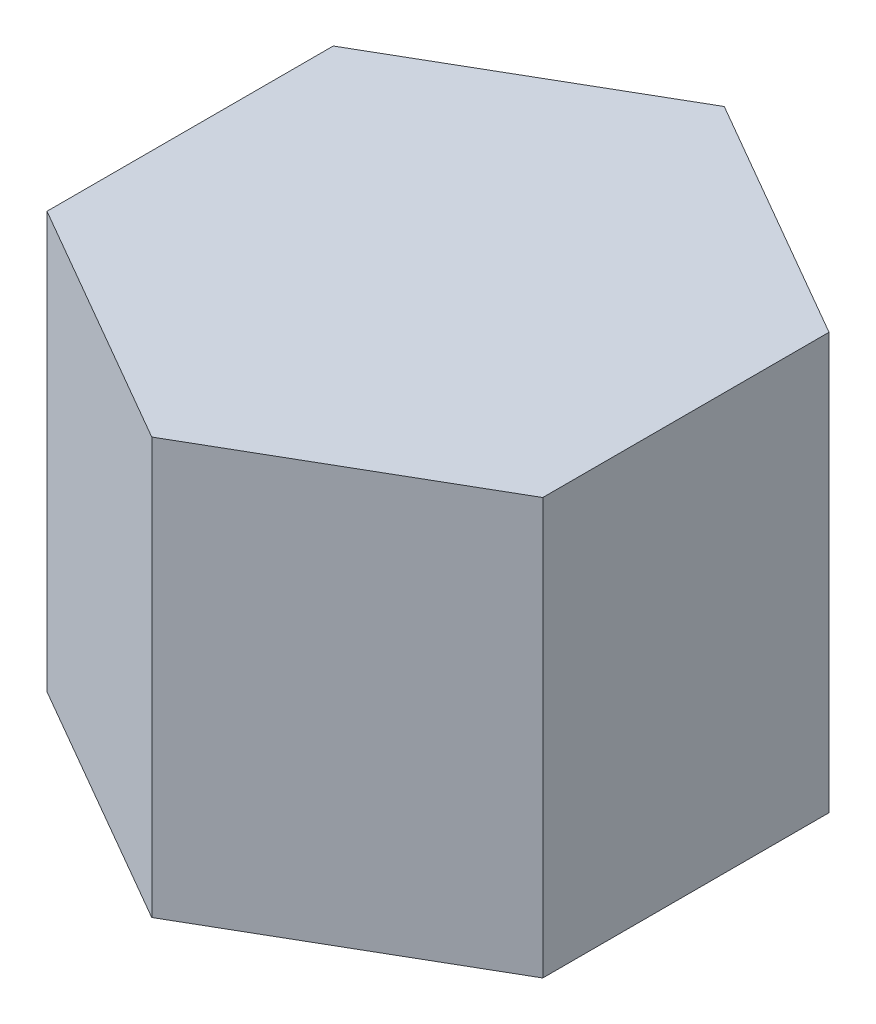
ISO-10303-21;
HEADER;
FILE_DESCRIPTION(('STEP AP214'),'2;1');
FILE_NAME('part.step','',(''),(''),'','','');
FILE_SCHEMA(('AUTOMOTIVE_DESIGN { 1 0 10303 214 1 1 1 1 }'));
ENDSEC;
DATA;
#1=APPLICATION_CONTEXT('core data for automotive mechanical design processes');
#2=APPLICATION_PROTOCOL_DEFINITION('international standard','automotive_design',2000,#1);
#3=PRODUCT_CONTEXT('',#1,'mechanical');
#4=PRODUCT('Part','Part','',(#3));
#5=PRODUCT_RELATED_PRODUCT_CATEGORY('part','',(#4));
#6=PRODUCT_DEFINITION_FORMATION('','',#4);
#7=PRODUCT_DEFINITION_CONTEXT('part definition',#1,'design');
#8=PRODUCT_DEFINITION('design','',#6,#7);
#9=PRODUCT_DEFINITION_SHAPE('','',#8);
#10=(LENGTH_UNIT() NAMED_UNIT(*) SI_UNIT(.MILLI.,.METRE.));
#11=(NAMED_UNIT(*) PLANE_ANGLE_UNIT() SI_UNIT($,.RADIAN.));
#12=(NAMED_UNIT(*) SI_UNIT($,.STERADIAN.) SOLID_ANGLE_UNIT());
#13=UNCERTAINTY_MEASURE_WITH_UNIT(LENGTH_MEASURE(1.E-05),#10,'distance_accuracy_value','');
#14=(GEOMETRIC_REPRESENTATION_CONTEXT(3) GLOBAL_UNCERTAINTY_ASSIGNED_CONTEXT((#13)) GLOBAL_UNIT_ASSIGNED_CONTEXT((#10,
#11,#12)) REPRESENTATION_CONTEXT('',''));
#15=CARTESIAN_POINT('',(0.,0.,0.));
#16=DIRECTION('',(0.,0.,1.));
#17=DIRECTION('',(1.,0.,0.));
#18=AXIS2_PLACEMENT_3D('',#15,#16,#17);
#19=CARTESIAN_POINT('',(206.339551417382,-147.556598747966,293.414022028063));
#20=DIRECTION('',(-0.500000000000096,0.,-0.866025403784383));
#21=DIRECTION('',(-0.866025403784383,0.,0.500000000000096));
#22=AXIS2_PLACEMENT_3D('',#19,#20,#21);
#23=PLANE('',#22);
#24=CARTESIAN_POINT('',(206.642660308706,-147.047793579175,293.239022028063));
#25=DIRECTION('',(-0.866025403784383,0.,0.500000000000096));
#26=VECTOR('',#25,1.);
#27=LINE('',#24,#26);
#28=CARTESIAN_POINT('',(206.642660308706,-147.047793579175,293.239022028063));
#29=VERTEX_POINT('',#28);
#30=CARTESIAN_POINT('',(206.339551417382,-147.047793579175,293.414022028063));
#31=VERTEX_POINT('',#30);
#32=EDGE_CURVE('E170',#29,#31,#27,.T.);
#33=ORIENTED_EDGE('',*,*,#32,.T.);
#34=CARTESIAN_POINT('',(206.339551417382,-147.556598747966,293.414022028063));
#35=DIRECTION('',(0.,1.,0.));
#36=VECTOR('',#35,1.);
#37=LINE('',#34,#36);
#38=CARTESIAN_POINT('',(206.339551417382,-147.556598747966,293.414022028063));
#39=VERTEX_POINT('',#38);
#40=EDGE_CURVE('E35',#39,#31,#37,.T.);
#41=ORIENTED_EDGE('',*,*,#40,.F.);
#42=CARTESIAN_POINT('',(206.642660308706,-147.556598747966,293.239022028063));
#43=DIRECTION('',(-0.866025403784383,0.,0.500000000000096));
#44=VECTOR('',#43,1.);
#45=LINE('',#42,#44);
#46=CARTESIAN_POINT('',(206.642660308706,-147.556598747966,293.239022028063));
#47=VERTEX_POINT('',#46);
#48=EDGE_CURVE('E159',#47,#39,#45,.T.);
#49=ORIENTED_EDGE('',*,*,#48,.F.);
#50=CARTESIAN_POINT('',(206.642660308706,-147.556598747966,293.239022028063));
#51=DIRECTION('',(0.,1.,0.));
#52=VECTOR('',#51,1.);
#53=LINE('',#50,#52);
#54=EDGE_CURVE('E10',#47,#29,#53,.T.);
#55=ORIENTED_EDGE('',*,*,#54,.T.);
#56=EDGE_LOOP('',(#33,#41,#49,#55));
#57=FACE_BOUND('',#56,.T.);
#58=ADVANCED_FACE('F16',(#57),#23,.F.);
#59=CARTESIAN_POINT('',(206.642660308706,-147.556598747966,291.594471220494));
#60=DIRECTION('',(-1.,0.,0.));
#61=DIRECTION('',(0.,-1.,0.));
#62=AXIS2_PLACEMENT_3D('',#59,#60,#61);
#63=PLANE('',#62);
#64=CARTESIAN_POINT('',(206.642660308706,-147.047793579175,292.889022028063));
#65=DIRECTION('',(0.,0.,1.));
#66=VECTOR('',#65,1.);
#67=LINE('',#64,#66);
#68=CARTESIAN_POINT('',(206.642660308706,-147.047793579175,292.889022028063));
#69=VERTEX_POINT('',#68);
#70=EDGE_CURVE('E167',#69,#29,#67,.T.);
#71=ORIENTED_EDGE('',*,*,#70,.T.);
#72=ORIENTED_EDGE('',*,*,#54,.F.);
#73=CARTESIAN_POINT('',(206.642660308706,-147.556598747966,292.889022028063));
#74=DIRECTION('',(0.,0.,1.));
#75=VECTOR('',#74,1.);
#76=LINE('',#73,#75);
#77=CARTESIAN_POINT('',(206.642660308706,-147.556598747966,292.889022028063));
#78=VERTEX_POINT('',#77);
#79=EDGE_CURVE('E156',#78,#47,#76,.T.);
#80=ORIENTED_EDGE('',*,*,#79,.F.);
#81=CARTESIAN_POINT('',(206.642660308706,-147.556598747966,292.889022028063));
#82=DIRECTION('',(0.,1.,0.));
#83=VECTOR('',#82,1.);
#84=LINE('',#81,#83);
#85=EDGE_CURVE('E27',#78,#69,#84,.T.);
#86=ORIENTED_EDGE('',*,*,#85,.T.);
#87=EDGE_LOOP('',(#71,#72,#80,#86));
#88=FACE_BOUND('',#87,.T.);
#89=ADVANCED_FACE('F189',(#88),#63,.F.);
#90=CARTESIAN_POINT('',(206.642660308706,-147.556598747966,292.889022028063));
#91=DIRECTION('',(-0.500000000000062,0.,0.866025403784403));
#92=DIRECTION('',(0.866025403784403,0.,0.500000000000062));
#93=AXIS2_PLACEMENT_3D('',#90,#91,#92);
#94=PLANE('',#93);
#95=CARTESIAN_POINT('',(206.339551417381,-147.047793579175,292.714022028063));
#96=DIRECTION('',(0.866025403784403,0.,0.500000000000062));
#97=VECTOR('',#96,1.);
#98=LINE('',#95,#97);
#99=CARTESIAN_POINT('',(206.339551417382,-147.047793579175,292.714022028063));
#100=VERTEX_POINT('',#99);
#101=EDGE_CURVE('E163',#100,#69,#98,.T.);
#102=ORIENTED_EDGE('',*,*,#101,.T.);
#103=ORIENTED_EDGE('',*,*,#85,.F.);
#104=CARTESIAN_POINT('',(206.339551417381,-147.556598747966,292.714022028063));
#105=DIRECTION('',(0.866025403784403,0.,0.500000000000062));
#106=VECTOR('',#105,1.);
#107=LINE('',#104,#106);
#108=CARTESIAN_POINT('',(206.339551417382,-147.556598747966,292.714022028063));
#109=VERTEX_POINT('',#108);
#110=EDGE_CURVE('E106',#109,#78,#107,.T.);
#111=ORIENTED_EDGE('',*,*,#110,.F.);
#112=CARTESIAN_POINT('',(206.339551417382,-147.556598747966,292.714022028063));
#113=DIRECTION('',(0.,1.,0.));
#114=VECTOR('',#113,1.);
#115=LINE('',#112,#114);
#116=EDGE_CURVE('E94',#109,#100,#115,.T.);
#117=ORIENTED_EDGE('',*,*,#116,.T.);
#118=EDGE_LOOP('',(#102,#103,#111,#117));
#119=FACE_BOUND('',#118,.T.);
#120=ADVANCED_FACE('F198',(#119),#94,.F.);
#121=CARTESIAN_POINT('',(206.339551417382,-147.556598747966,292.714022028063));
#122=DIRECTION('',(0.499999999999943,0.,0.866025403784471));
#123=DIRECTION('',(0.866025403784471,0.,-0.499999999999943));
#124=AXIS2_PLACEMENT_3D('',#121,#122,#123);
#125=PLANE('',#124);
#126=CARTESIAN_POINT('',(206.036442526057,-147.047793579175,292.889022028063));
#127=DIRECTION('',(0.866025403784471,0.,-0.499999999999943));
#128=VECTOR('',#127,1.);
#129=LINE('',#126,#128);
#130=CARTESIAN_POINT('',(206.036442526057,-147.047793579175,292.889022028063));
#131=VERTEX_POINT('',#130);
#132=EDGE_CURVE('E162',#131,#100,#129,.T.);
#133=ORIENTED_EDGE('',*,*,#132,.T.);
#134=ORIENTED_EDGE('',*,*,#116,.F.);
#135=CARTESIAN_POINT('',(206.036442526057,-147.556598747966,292.889022028063));
#136=DIRECTION('',(0.866025403784471,0.,-0.499999999999943));
#137=VECTOR('',#136,1.);
#138=LINE('',#135,#137);
#139=CARTESIAN_POINT('',(206.036442526057,-147.556598747966,292.889022028063));
#140=VERTEX_POINT('',#139);
#141=EDGE_CURVE('E98',#140,#109,#138,.T.);
#142=ORIENTED_EDGE('',*,*,#141,.F.);
#143=CARTESIAN_POINT('',(206.036442526057,-147.556598747966,292.889022028063));
#144=DIRECTION('',(0.,1.,0.));
#145=VECTOR('',#144,1.);
#146=LINE('',#143,#145);
#147=EDGE_CURVE('E79',#140,#131,#146,.T.);
#148=ORIENTED_EDGE('',*,*,#147,.T.);
#149=EDGE_LOOP('',(#133,#134,#142,#148));
#150=FACE_BOUND('',#149,.T.);
#151=ADVANCED_FACE('F100',(#150),#125,.F.);
#152=CARTESIAN_POINT('',(206.036442526057,-147.556598747966,291.594471220494));
#153=DIRECTION('',(1.,0.,0.));
#154=DIRECTION('',(0.,1.,0.));
#155=AXIS2_PLACEMENT_3D('',#152,#153,#154);
#156=PLANE('',#155);
#157=CARTESIAN_POINT('',(206.036442526057,-147.047793579175,293.239022028063));
#158=DIRECTION('',(0.,0.,-1.));
#159=VECTOR('',#158,1.);
#160=LINE('',#157,#159);
#161=CARTESIAN_POINT('',(206.036442526057,-147.047793579175,293.239022028063));
#162=VERTEX_POINT('',#161);
#163=EDGE_CURVE('E88',#162,#131,#160,.T.);
#164=ORIENTED_EDGE('',*,*,#163,.T.);
#165=ORIENTED_EDGE('',*,*,#147,.F.);
#166=CARTESIAN_POINT('',(206.036442526057,-147.556598747966,293.239022028063));
#167=DIRECTION('',(0.,0.,-1.));
#168=VECTOR('',#167,1.);
#169=LINE('',#166,#168);
#170=CARTESIAN_POINT('',(206.036442526057,-147.556598747966,293.239022028063));
#171=VERTEX_POINT('',#170);
#172=EDGE_CURVE('E84',#171,#140,#169,.T.);
#173=ORIENTED_EDGE('',*,*,#172,.F.);
#174=CARTESIAN_POINT('',(206.036442526057,-147.556598747966,293.239022028063));
#175=DIRECTION('',(0.,1.,0.));
#176=VECTOR('',#175,1.);
#177=LINE('',#174,#176);
#178=EDGE_CURVE('E58',#171,#162,#177,.T.);
#179=ORIENTED_EDGE('',*,*,#178,.T.);
#180=EDGE_LOOP('',(#164,#165,#173,#179));
#181=FACE_BOUND('',#180,.T.);
#182=ADVANCED_FACE('F82',(#181),#156,.F.);
#183=CARTESIAN_POINT('',(206.036442526057,-147.556598747966,293.239022028063));
#184=DIRECTION('',(0.500000000000062,0.,-0.866025403784403));
#185=DIRECTION('',(-0.866025403784403,0.,-0.500000000000062));
#186=AXIS2_PLACEMENT_3D('',#183,#184,#185);
#187=PLANE('',#186);
#188=CARTESIAN_POINT('',(206.339551417382,-147.047793579175,293.414022028063));
#189=DIRECTION('',(-0.866025403784403,0.,-0.500000000000062));
#190=VECTOR('',#189,1.);
#191=LINE('',#188,#190);
#192=EDGE_CURVE('E160',#31,#162,#191,.T.);
#193=ORIENTED_EDGE('',*,*,#192,.T.);
#194=ORIENTED_EDGE('',*,*,#178,.F.);
#195=CARTESIAN_POINT('',(206.339551417382,-147.556598747966,293.414022028063));
#196=DIRECTION('',(-0.866025403784403,0.,-0.500000000000062));
#197=VECTOR('',#196,1.);
#198=LINE('',#195,#197);
#199=EDGE_CURVE('E112',#39,#171,#198,.T.);
#200=ORIENTED_EDGE('',*,*,#199,.F.);
#201=ORIENTED_EDGE('',*,*,#40,.T.);
#202=EDGE_LOOP('',(#193,#194,#200,#201));
#203=FACE_BOUND('',#202,.T.);
#204=ADVANCED_FACE('F131',(#203),#187,.F.);
#205=CARTESIAN_POINT('',(206.491105863044,-147.556598747966,291.594471220494));
#206=DIRECTION('',(0.,1.,0.));
#207=DIRECTION('',(-1.,0.,0.));
#208=AXIS2_PLACEMENT_3D('',#205,#206,#207);
#209=PLANE('',#208);
#210=ORIENTED_EDGE('',*,*,#48,.T.);
#211=ORIENTED_EDGE('',*,*,#199,.T.);
#212=ORIENTED_EDGE('',*,*,#172,.T.);
#213=ORIENTED_EDGE('',*,*,#141,.T.);
#214=ORIENTED_EDGE('',*,*,#110,.T.);
#215=ORIENTED_EDGE('',*,*,#79,.T.);
#216=EDGE_LOOP('',(#210,#211,#212,#213,#214,#215));
#217=FACE_BOUND('',#216,.T.);
#218=ADVANCED_FACE('F111',(#217),#209,.F.);
#219=CARTESIAN_POINT('',(206.491105863044,-147.047793579175,291.594471220494));
#220=DIRECTION('',(0.,1.,0.));
#221=DIRECTION('',(-1.,0.,0.));
#222=AXIS2_PLACEMENT_3D('',#219,#220,#221);
#223=PLANE('',#222);
#224=ORIENTED_EDGE('',*,*,#32,.F.);
#225=ORIENTED_EDGE('',*,*,#70,.F.);
#226=ORIENTED_EDGE('',*,*,#101,.F.);
#227=ORIENTED_EDGE('',*,*,#132,.F.);
#228=ORIENTED_EDGE('',*,*,#163,.F.);
#229=ORIENTED_EDGE('',*,*,#192,.F.);
#230=EDGE_LOOP('',(#224,#225,#226,#227,#228,#229));
#231=FACE_BOUND('',#230,.T.);
#232=ADVANCED_FACE('F130',(#231),#223,.T.);
#233=CLOSED_SHELL('',(#58,#89,#120,#151,#182,#204,#218,#232));
#234=MANIFOLD_SOLID_BREP('B1',#233);
#235=ADVANCED_BREP_SHAPE_REPRESENTATION('',(#18,#234),#14);
#236=SHAPE_DEFINITION_REPRESENTATION(#9,#235);
ENDSEC;
END-ISO-10303-21;
